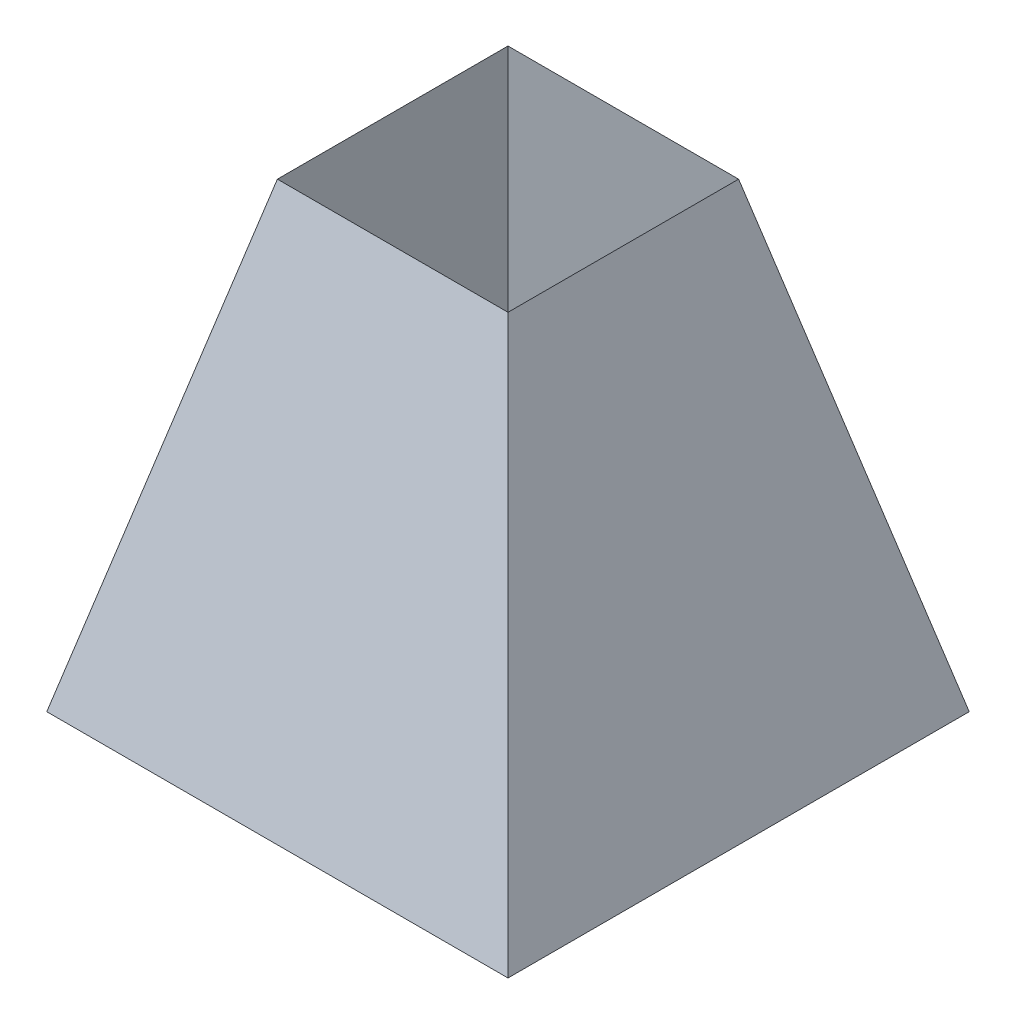
ISO-10303-21;
HEADER;
FILE_DESCRIPTION(('STEP AP214'),'2;1');
FILE_NAME('part.step','',(''),(''),'','','');
FILE_SCHEMA(('AUTOMOTIVE_DESIGN { 1 0 10303 214 1 1 1 1 }'));
ENDSEC;
DATA;
#1=APPLICATION_CONTEXT('core data for automotive mechanical design processes');
#2=APPLICATION_PROTOCOL_DEFINITION('international standard','automotive_design',2000,#1);
#3=PRODUCT_CONTEXT('',#1,'mechanical');
#4=PRODUCT('Part','Part','',(#3));
#5=PRODUCT_RELATED_PRODUCT_CATEGORY('part','',(#4));
#6=PRODUCT_DEFINITION_FORMATION('','',#4);
#7=PRODUCT_DEFINITION_CONTEXT('part definition',#1,'design');
#8=PRODUCT_DEFINITION('design','',#6,#7);
#9=PRODUCT_DEFINITION_SHAPE('','',#8);
#10=(LENGTH_UNIT() NAMED_UNIT(*) SI_UNIT(.MILLI.,.METRE.));
#11=(NAMED_UNIT(*) PLANE_ANGLE_UNIT() SI_UNIT($,.RADIAN.));
#12=(NAMED_UNIT(*) SI_UNIT($,.STERADIAN.) SOLID_ANGLE_UNIT());
#13=UNCERTAINTY_MEASURE_WITH_UNIT(LENGTH_MEASURE(1.E-05),#10,'distance_accuracy_value','');
#14=(GEOMETRIC_REPRESENTATION_CONTEXT(3) GLOBAL_UNCERTAINTY_ASSIGNED_CONTEXT((#13)) GLOBAL_UNIT_ASSIGNED_CONTEXT((#10,
#11,#12)) REPRESENTATION_CONTEXT('',''));
#15=CARTESIAN_POINT('',(0.,0.,0.));
#16=DIRECTION('',(0.,0.,1.));
#17=DIRECTION('',(1.,0.,0.));
#18=AXIS2_PLACEMENT_3D('',#15,#16,#17);
#19=CARTESIAN_POINT('',(0.,0.,0.));
#20=DIRECTION('',(0.,1.,0.));
#21=DIRECTION('',(0.,0.,1.));
#22=AXIS2_PLACEMENT_3D('',#19,#20,#21);
#23=PLANE('',#22);
#24=DIRECTION('',(1.,0.,0.));
#25=VECTOR('',#24,1.);
#26=CARTESIAN_POINT('',(0.,3.88578058618805E-13,79.3578976115259));
#27=LINE('',#26,#25);
#28=CARTESIAN_POINT('',(-79.3578976115259,3.88578058618805E-13,79.3578976115259));
#29=VERTEX_POINT('',#28);
#30=CARTESIAN_POINT('',(79.3578976115259,3.88578058618805E-13,79.3578976115259));
#31=VERTEX_POINT('',#30);
#32=EDGE_CURVE('E104',#29,#31,#27,.T.);
#33=ORIENTED_EDGE('',*,*,#32,.T.);
#34=DIRECTION('',(0.,0.,-1.));
#35=VECTOR('',#34,1.);
#36=CARTESIAN_POINT('',(79.3578976115259,3.88578058618805E-13,0.));
#37=LINE('',#36,#35);
#38=CARTESIAN_POINT('',(79.3578976115259,3.88578058618805E-13,-79.3578976115259));
#39=VERTEX_POINT('',#38);
#40=EDGE_CURVE('E409',#31,#39,#37,.T.);
#41=ORIENTED_EDGE('',*,*,#40,.T.);
#42=DIRECTION('',(-1.,0.,0.));
#43=VECTOR('',#42,1.);
#44=CARTESIAN_POINT('',(0.,3.88578058618805E-13,-79.3578976115259));
#45=LINE('',#44,#43);
#46=CARTESIAN_POINT('',(-79.3578976115259,0.,-79.357897611526));
#47=VERTEX_POINT('',#46);
#48=EDGE_CURVE('E99',#39,#47,#45,.T.);
#49=ORIENTED_EDGE('',*,*,#48,.T.);
#50=DIRECTION('',(0.,0.,1.));
#51=VECTOR('',#50,1.);
#52=CARTESIAN_POINT('',(-79.3578976115259,3.88578058618805E-13,0.));
#53=LINE('',#52,#51);
#54=EDGE_CURVE('E60',#47,#29,#53,.T.);
#55=ORIENTED_EDGE('',*,*,#54,.T.);
#56=EDGE_LOOP('',(#33,#41,#49,#55));
#57=FACE_BOUND('',#56,.T.);
#58=DIRECTION('',(0.,0.,-1.));
#59=VECTOR('',#58,1.);
#60=CARTESIAN_POINT('',(101.6,0.,-101.6));
#61=LINE('',#60,#59);
#62=CARTESIAN_POINT('',(101.6,0.,101.6));
#63=VERTEX_POINT('',#62);
#64=CARTESIAN_POINT('',(101.6,0.,-101.6));
#65=VERTEX_POINT('',#64);
#66=EDGE_CURVE('E127',#63,#65,#61,.T.);
#67=ORIENTED_EDGE('',*,*,#66,.F.);
#68=DIRECTION('',(1.,0.,0.));
#69=VECTOR('',#68,1.);
#70=CARTESIAN_POINT('',(-101.6,0.,101.6));
#71=LINE('',#70,#69);
#72=CARTESIAN_POINT('',(-101.6,0.,101.6));
#73=VERTEX_POINT('',#72);
#74=EDGE_CURVE('E195',#73,#63,#71,.T.);
#75=ORIENTED_EDGE('',*,*,#74,.F.);
#76=DIRECTION('',(0.,0.,1.));
#77=VECTOR('',#76,1.);
#78=CARTESIAN_POINT('',(-101.6,0.,-101.6));
#79=LINE('',#78,#77);
#80=CARTESIAN_POINT('',(-101.6,0.,-101.6));
#81=VERTEX_POINT('',#80);
#82=EDGE_CURVE('E179',#81,#73,#79,.T.);
#83=ORIENTED_EDGE('',*,*,#82,.F.);
#84=DIRECTION('',(-1.,0.,0.));
#85=VECTOR('',#84,1.);
#86=CARTESIAN_POINT('',(-101.6,0.,-101.6));
#87=LINE('',#86,#85);
#88=EDGE_CURVE('E132',#65,#81,#87,.T.);
#89=ORIENTED_EDGE('',*,*,#88,.F.);
#90=EDGE_LOOP('',(#67,#75,#83,#89));
#91=FACE_BOUND('',#90,.T.);
#92=ADVANCED_FACE('F43',(#57,#91),#23,.F.);
#93=CARTESIAN_POINT('',(95.6235294117647,23.9058823529412,0.));
#94=DIRECTION('',(-0.970142500145332,-0.242535625036333,0.));
#95=DIRECTION('',(0.242535625036333,-0.970142500145332,0.));
#96=AXIS2_PLACEMENT_3D('',#93,#94,#95);
#97=PLANE('',#96);
#98=DIRECTION('',(-0.235702260395516,0.942809041582063,0.235702260395516));
#99=VECTOR('',#98,1.);
#100=CARTESIAN_POINT('',(101.6,0.,-101.6));
#101=LINE('',#100,#99);
#102=CARTESIAN_POINT('',(50.8,203.2,-50.8));
#103=VERTEX_POINT('',#102);
#104=EDGE_CURVE('E124',#65,#103,#101,.T.);
#105=ORIENTED_EDGE('',*,*,#104,.T.);
#106=DIRECTION('',(0.,0.,-1.));
#107=VECTOR('',#106,1.);
#108=CARTESIAN_POINT('',(50.8,203.2,-50.8));
#109=LINE('',#108,#107);
#110=CARTESIAN_POINT('',(50.8,203.2,50.8));
#111=VERTEX_POINT('',#110);
#112=EDGE_CURVE('E107',#111,#103,#109,.T.);
#113=ORIENTED_EDGE('',*,*,#112,.F.);
#114=DIRECTION('',(-0.235702260395516,0.942809041582063,-0.235702260395516));
#115=VECTOR('',#114,1.);
#116=CARTESIAN_POINT('',(101.6,0.,101.6));
#117=LINE('',#116,#115);
#118=EDGE_CURVE('E131',#63,#111,#117,.T.);
#119=ORIENTED_EDGE('',*,*,#118,.F.);
#120=ORIENTED_EDGE('',*,*,#66,.T.);
#121=EDGE_LOOP('',(#105,#113,#119,#120));
#122=FACE_BOUND('',#121,.T.);
#123=ADVANCED_FACE('F125',(#122),#97,.F.);
#124=CARTESIAN_POINT('',(0.,23.9058823529412,95.6235294117647));
#125=DIRECTION('',(0.,-0.242535625036333,-0.970142500145332));
#126=DIRECTION('',(0.,0.970142500145332,-0.242535625036333));
#127=AXIS2_PLACEMENT_3D('',#124,#125,#126);
#128=PLANE('',#127);
#129=ORIENTED_EDGE('',*,*,#118,.T.);
#130=DIRECTION('',(1.,0.,0.));
#131=VECTOR('',#130,1.);
#132=CARTESIAN_POINT('',(-50.8,203.2,50.8));
#133=LINE('',#132,#131);
#134=CARTESIAN_POINT('',(-50.8,203.2,50.8));
#135=VERTEX_POINT('',#134);
#136=EDGE_CURVE('E117',#135,#111,#133,.T.);
#137=ORIENTED_EDGE('',*,*,#136,.F.);
#138=DIRECTION('',(0.235702260395516,0.942809041582063,-0.235702260395516));
#139=VECTOR('',#138,1.);
#140=CARTESIAN_POINT('',(-101.6,0.,101.6));
#141=LINE('',#140,#139);
#142=EDGE_CURVE('E118',#73,#135,#141,.T.);
#143=ORIENTED_EDGE('',*,*,#142,.F.);
#144=ORIENTED_EDGE('',*,*,#74,.T.);
#145=EDGE_LOOP('',(#129,#137,#143,#144));
#146=FACE_BOUND('',#145,.T.);
#147=ADVANCED_FACE('F156',(#146),#128,.F.);
#148=CARTESIAN_POINT('',(0.,23.9058823529412,-95.6235294117647));
#149=DIRECTION('',(0.,-0.242535625036333,0.970142500145332));
#150=DIRECTION('',(0.,-0.970142500145332,-0.242535625036333));
#151=AXIS2_PLACEMENT_3D('',#148,#149,#150);
#152=PLANE('',#151);
#153=DIRECTION('',(0.235702260395516,0.942809041582063,0.235702260395516));
#154=VECTOR('',#153,1.);
#155=CARTESIAN_POINT('',(-101.6,0.,-101.6));
#156=LINE('',#155,#154);
#157=CARTESIAN_POINT('',(-50.8,203.2,-50.8));
#158=VERTEX_POINT('',#157);
#159=EDGE_CURVE('E137',#81,#158,#156,.T.);
#160=ORIENTED_EDGE('',*,*,#159,.T.);
#161=DIRECTION('',(-1.,0.,0.));
#162=VECTOR('',#161,1.);
#163=CARTESIAN_POINT('',(-50.8,203.2,-50.8));
#164=LINE('',#163,#162);
#165=EDGE_CURVE('E12',#103,#158,#164,.T.);
#166=ORIENTED_EDGE('',*,*,#165,.F.);
#167=ORIENTED_EDGE('',*,*,#104,.F.);
#168=ORIENTED_EDGE('',*,*,#88,.T.);
#169=EDGE_LOOP('',(#160,#166,#167,#168));
#170=FACE_BOUND('',#169,.T.);
#171=ADVANCED_FACE('F136',(#170),#152,.F.);
#172=CARTESIAN_POINT('',(-95.6235294117647,23.9058823529411,0.));
#173=DIRECTION('',(0.970142500145332,-0.242535625036333,0.));
#174=DIRECTION('',(0.242535625036333,0.970142500145332,0.));
#175=AXIS2_PLACEMENT_3D('',#172,#173,#174);
#176=PLANE('',#175);
#177=ORIENTED_EDGE('',*,*,#142,.T.);
#178=DIRECTION('',(0.,0.,1.));
#179=VECTOR('',#178,1.);
#180=CARTESIAN_POINT('',(-50.8,203.2,-50.8));
#181=LINE('',#180,#179);
#182=EDGE_CURVE('E53',#158,#135,#181,.T.);
#183=ORIENTED_EDGE('',*,*,#182,.F.);
#184=ORIENTED_EDGE('',*,*,#159,.F.);
#185=ORIENTED_EDGE('',*,*,#82,.T.);
#186=EDGE_LOOP('',(#177,#183,#184,#185));
#187=FACE_BOUND('',#186,.T.);
#188=ADVANCED_FACE('F45',(#187),#176,.F.);
#189=CARTESIAN_POINT('',(50.8,203.2,-50.8));
#190=DIRECTION('',(0.99026806874157,0.139173100960065,0.));
#191=DIRECTION('',(-0.139173100960065,0.99026806874157,0.));
#192=AXIS2_PLACEMENT_3D('',#189,#190,#191);
#193=PLANE('',#192);
#194=ORIENTED_EDGE('',*,*,#112,.T.);
#195=DIRECTION('',(-0.137844537491629,0.980814848463989,0.137844537491629));
#196=VECTOR('',#195,1.);
#197=CARTESIAN_POINT('',(50.8,203.2,-50.8));
#198=LINE('',#197,#196);
#199=EDGE_CURVE('E95',#39,#103,#198,.T.);
#200=ORIENTED_EDGE('',*,*,#199,.F.);
#201=ORIENTED_EDGE('',*,*,#40,.F.);
#202=DIRECTION('',(-0.137844537491629,0.980814848463989,-0.137844537491629));
#203=VECTOR('',#202,1.);
#204=CARTESIAN_POINT('',(48.8694865619458,216.936316865786,48.8694865619459));
#205=LINE('',#204,#203);
#206=EDGE_CURVE('E111',#31,#111,#205,.T.);
#207=ORIENTED_EDGE('',*,*,#206,.T.);
#208=EDGE_LOOP('',(#194,#200,#201,#207));
#209=FACE_BOUND('',#208,.T.);
#210=ADVANCED_FACE('F110',(#209),#193,.F.);
#211=CARTESIAN_POINT('',(-50.8,203.2,50.8));
#212=DIRECTION('',(0.,0.139173100960065,0.99026806874157));
#213=DIRECTION('',(0.,-0.99026806874157,0.139173100960065));
#214=AXIS2_PLACEMENT_3D('',#211,#212,#213);
#215=PLANE('',#214);
#216=ORIENTED_EDGE('',*,*,#136,.T.);
#217=ORIENTED_EDGE('',*,*,#206,.F.);
#218=ORIENTED_EDGE('',*,*,#32,.F.);
#219=DIRECTION('',(0.137844537491629,0.980814848463989,-0.137844537491629));
#220=VECTOR('',#219,1.);
#221=CARTESIAN_POINT('',(-48.8694865619458,216.936316865786,48.8694865619459));
#222=LINE('',#221,#220);
#223=EDGE_CURVE('E394',#29,#135,#222,.T.);
#224=ORIENTED_EDGE('',*,*,#223,.T.);
#225=EDGE_LOOP('',(#216,#217,#218,#224));
#226=FACE_BOUND('',#225,.T.);
#227=ADVANCED_FACE('F231',(#226),#215,.F.);
#228=CARTESIAN_POINT('',(-50.8,203.2,-50.8));
#229=DIRECTION('',(-0.99026806874157,0.139173100960065,0.));
#230=DIRECTION('',(-0.139173100960065,-0.99026806874157,0.));
#231=AXIS2_PLACEMENT_3D('',#228,#229,#230);
#232=PLANE('',#231);
#233=ORIENTED_EDGE('',*,*,#182,.T.);
#234=ORIENTED_EDGE('',*,*,#223,.F.);
#235=ORIENTED_EDGE('',*,*,#54,.F.);
#236=DIRECTION('',(0.137844537491629,0.980814848463989,0.137844537491629));
#237=VECTOR('',#236,1.);
#238=CARTESIAN_POINT('',(-50.8,203.2,-50.8));
#239=LINE('',#238,#237);
#240=EDGE_CURVE('E103',#47,#158,#239,.T.);
#241=ORIENTED_EDGE('',*,*,#240,.T.);
#242=EDGE_LOOP('',(#233,#234,#235,#241));
#243=FACE_BOUND('',#242,.T.);
#244=ADVANCED_FACE('F322',(#243),#232,.F.);
#245=CARTESIAN_POINT('',(-50.8,203.2,-50.8));
#246=DIRECTION('',(0.,0.139173100960065,-0.99026806874157));
#247=DIRECTION('',(0.,0.99026806874157,0.139173100960065));
#248=AXIS2_PLACEMENT_3D('',#245,#246,#247);
#249=PLANE('',#248);
#250=ORIENTED_EDGE('',*,*,#165,.T.);
#251=ORIENTED_EDGE('',*,*,#240,.F.);
#252=ORIENTED_EDGE('',*,*,#48,.F.);
#253=ORIENTED_EDGE('',*,*,#199,.T.);
#254=EDGE_LOOP('',(#250,#251,#252,#253));
#255=FACE_BOUND('',#254,.T.);
#256=ADVANCED_FACE('F97',(#255),#249,.F.);
#257=CLOSED_SHELL('',(#92,#123,#147,#171,#188,#210,#227,#244,#256));
#258=MANIFOLD_SOLID_BREP('B2',#257);
#259=ADVANCED_BREP_SHAPE_REPRESENTATION('',(#18,#258),#14);
#260=SHAPE_DEFINITION_REPRESENTATION(#9,#259);
ENDSEC;
END-ISO-10303-21;
